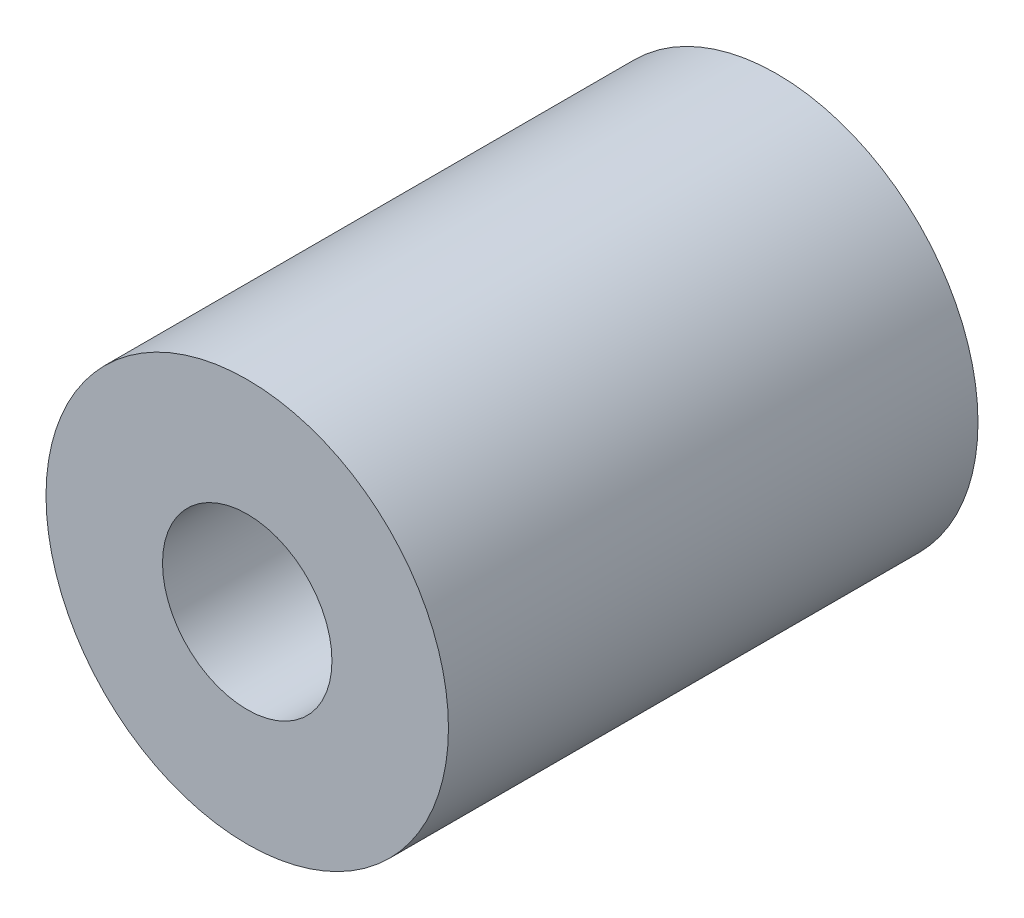
ISO-10303-21;
HEADER;
FILE_DESCRIPTION(('STEP AP214'),'2;1');
FILE_NAME('part.step','',(''),(''),'','','');
FILE_SCHEMA(('AUTOMOTIVE_DESIGN { 1 0 10303 214 1 1 1 1 }'));
ENDSEC;
DATA;
#1=APPLICATION_CONTEXT('core data for automotive mechanical design processes');
#2=APPLICATION_PROTOCOL_DEFINITION('international standard','automotive_design',2000,#1);
#3=PRODUCT_CONTEXT('',#1,'mechanical');
#4=PRODUCT('Part','Part','',(#3));
#5=PRODUCT_RELATED_PRODUCT_CATEGORY('part','',(#4));
#6=PRODUCT_DEFINITION_FORMATION('','',#4);
#7=PRODUCT_DEFINITION_CONTEXT('part definition',#1,'design');
#8=PRODUCT_DEFINITION('design','',#6,#7);
#9=PRODUCT_DEFINITION_SHAPE('','',#8);
#10=(LENGTH_UNIT() NAMED_UNIT(*) SI_UNIT(.MILLI.,.METRE.));
#11=(NAMED_UNIT(*) PLANE_ANGLE_UNIT() SI_UNIT($,.RADIAN.));
#12=(NAMED_UNIT(*) SI_UNIT($,.STERADIAN.) SOLID_ANGLE_UNIT());
#13=UNCERTAINTY_MEASURE_WITH_UNIT(LENGTH_MEASURE(1.E-05),#10,'distance_accuracy_value','');
#14=(GEOMETRIC_REPRESENTATION_CONTEXT(3) GLOBAL_UNCERTAINTY_ASSIGNED_CONTEXT((#13)) GLOBAL_UNIT_ASSIGNED_CONTEXT((#10,
#11,#12)) REPRESENTATION_CONTEXT('',''));
#15=CARTESIAN_POINT('',(0.,0.,0.));
#16=DIRECTION('',(0.,0.,1.));
#17=DIRECTION('',(1.,0.,0.));
#18=AXIS2_PLACEMENT_3D('',#15,#16,#17);
#19=CARTESIAN_POINT('',(0.,0.,25.));
#20=DIRECTION('',(0.,0.,1.));
#21=DIRECTION('',(1.,0.,0.));
#22=AXIS2_PLACEMENT_3D('',#19,#20,#21);
#23=PLANE('',#22);
#24=CARTESIAN_POINT('',(0.,0.,25.));
#25=DIRECTION('',(0.,0.,1.));
#26=DIRECTION('',(1.,0.,0.));
#27=AXIS2_PLACEMENT_3D('',#24,#25,#26);
#28=CIRCLE('',#27,9.5);
#29=CARTESIAN_POINT('',(9.5,0.,25.));
#30=VERTEX_POINT('',#29);
#31=EDGE_CURVE('E10',#30,#30,#28,.T.);
#32=ORIENTED_EDGE('',*,*,#31,.T.);
#33=EDGE_LOOP('',(#32));
#34=FACE_BOUND('',#33,.T.);
#35=CARTESIAN_POINT('',(0.,0.,25.));
#36=DIRECTION('',(0.,0.,1.));
#37=DIRECTION('',(1.,0.,0.));
#38=AXIS2_PLACEMENT_3D('',#35,#36,#37);
#39=CIRCLE('',#38,4.);
#40=CARTESIAN_POINT('',(4.,0.,25.));
#41=VERTEX_POINT('',#40);
#42=EDGE_CURVE('E48',#41,#41,#39,.T.);
#43=ORIENTED_EDGE('',*,*,#42,.F.);
#44=EDGE_LOOP('',(#43));
#45=FACE_BOUND('',#44,.T.);
#46=ADVANCED_FACE('F37',(#34,#45),#23,.T.);
#47=CARTESIAN_POINT('',(0.,0.,0.));
#48=DIRECTION('',(0.,0.,1.));
#49=DIRECTION('',(1.,0.,0.));
#50=AXIS2_PLACEMENT_3D('',#47,#48,#49);
#51=PLANE('',#50);
#52=CARTESIAN_POINT('',(0.,0.,0.));
#53=DIRECTION('',(0.,0.,1.));
#54=DIRECTION('',(1.,0.,0.));
#55=AXIS2_PLACEMENT_3D('',#52,#53,#54);
#56=CIRCLE('',#55,9.5);
#57=CARTESIAN_POINT('',(9.5,0.,0.));
#58=VERTEX_POINT('',#57);
#59=EDGE_CURVE('E41',#58,#58,#56,.T.);
#60=ORIENTED_EDGE('',*,*,#59,.F.);
#61=EDGE_LOOP('',(#60));
#62=FACE_BOUND('',#61,.T.);
#63=CARTESIAN_POINT('',(0.,0.,0.));
#64=DIRECTION('',(0.,0.,1.));
#65=DIRECTION('',(1.,0.,0.));
#66=AXIS2_PLACEMENT_3D('',#63,#64,#65);
#67=CIRCLE('',#66,4.);
#68=CARTESIAN_POINT('',(4.,0.,0.));
#69=VERTEX_POINT('',#68);
#70=EDGE_CURVE('E50',#69,#69,#67,.T.);
#71=ORIENTED_EDGE('',*,*,#70,.T.);
#72=EDGE_LOOP('',(#71));
#73=FACE_BOUND('',#72,.T.);
#74=ADVANCED_FACE('F60',(#62,#73),#51,.F.);
#75=CARTESIAN_POINT('',(0.,0.,25.));
#76=DIRECTION('',(0.,0.,-1.));
#77=DIRECTION('',(-1.,0.,0.));
#78=AXIS2_PLACEMENT_3D('',#75,#76,#77);
#79=CYLINDRICAL_SURFACE('',#78,9.5);
#80=ORIENTED_EDGE('',*,*,#31,.F.);
#81=EDGE_LOOP('',(#80));
#82=FACE_BOUND('',#81,.T.);
#83=ORIENTED_EDGE('',*,*,#59,.T.);
#84=EDGE_LOOP('',(#83));
#85=FACE_BOUND('',#84,.T.);
#86=ADVANCED_FACE('F39',(#82,#85),#79,.T.);
#87=CARTESIAN_POINT('',(0.,0.,25.));
#88=DIRECTION('',(0.,0.,-1.));
#89=DIRECTION('',(-1.,0.,0.));
#90=AXIS2_PLACEMENT_3D('',#87,#88,#89);
#91=CYLINDRICAL_SURFACE('',#90,4.);
#92=ORIENTED_EDGE('',*,*,#42,.T.);
#93=EDGE_LOOP('',(#92));
#94=FACE_BOUND('',#93,.T.);
#95=ORIENTED_EDGE('',*,*,#70,.F.);
#96=EDGE_LOOP('',(#95));
#97=FACE_BOUND('',#96,.T.);
#98=ADVANCED_FACE('F56',(#94,#97),#91,.F.);
#99=CLOSED_SHELL('',(#46,#74,#86,#98));
#100=MANIFOLD_SOLID_BREP('B2',#99);
#101=ADVANCED_BREP_SHAPE_REPRESENTATION('',(#18,#100),#14);
#102=SHAPE_DEFINITION_REPRESENTATION(#9,#101);
ENDSEC;
END-ISO-10303-21;
